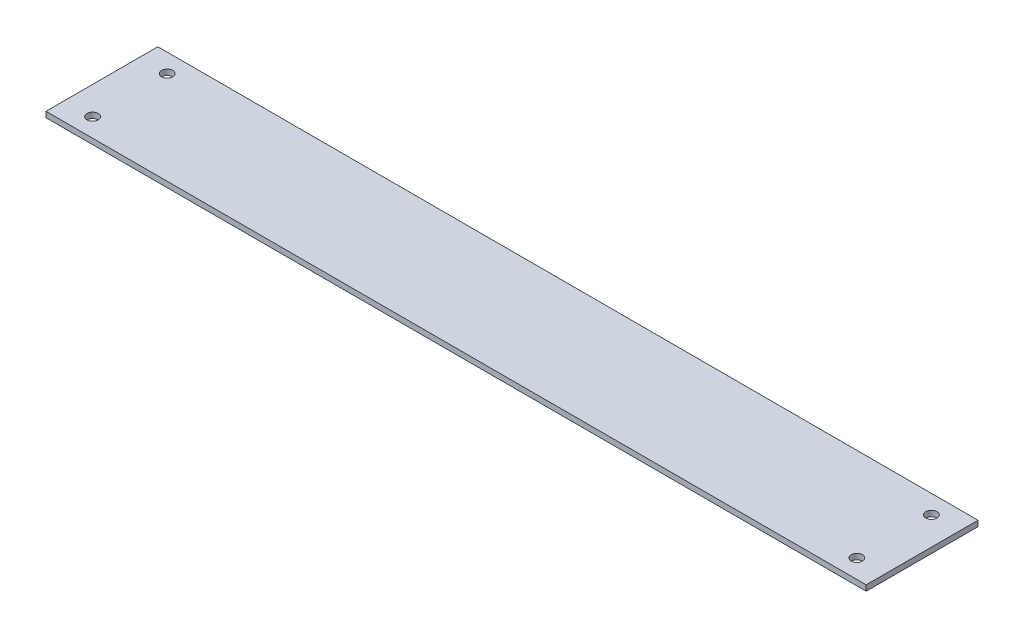
ISO-10303-21;
HEADER;
FILE_DESCRIPTION(('STEP AP214'),'2;1');
FILE_NAME('part.step','',(''),(''),'','','');
FILE_SCHEMA(('AUTOMOTIVE_DESIGN { 1 0 10303 214 1 1 1 1 }'));
ENDSEC;
DATA;
#1=APPLICATION_CONTEXT('core data for automotive mechanical design processes');
#2=APPLICATION_PROTOCOL_DEFINITION('international standard','automotive_design',2000,#1);
#3=PRODUCT_CONTEXT('',#1,'mechanical');
#4=PRODUCT('Part','Part','',(#3));
#5=PRODUCT_RELATED_PRODUCT_CATEGORY('part','',(#4));
#6=PRODUCT_DEFINITION_FORMATION('','',#4);
#7=PRODUCT_DEFINITION_CONTEXT('part definition',#1,'design');
#8=PRODUCT_DEFINITION('design','',#6,#7);
#9=PRODUCT_DEFINITION_SHAPE('','',#8);
#10=(LENGTH_UNIT() NAMED_UNIT(*) SI_UNIT(.MILLI.,.METRE.));
#11=(NAMED_UNIT(*) PLANE_ANGLE_UNIT() SI_UNIT($,.RADIAN.));
#12=(NAMED_UNIT(*) SI_UNIT($,.STERADIAN.) SOLID_ANGLE_UNIT());
#13=UNCERTAINTY_MEASURE_WITH_UNIT(LENGTH_MEASURE(1.E-05),#10,'distance_accuracy_value','');
#14=(GEOMETRIC_REPRESENTATION_CONTEXT(3) GLOBAL_UNCERTAINTY_ASSIGNED_CONTEXT((#13)) GLOBAL_UNIT_ASSIGNED_CONTEXT((#10,
#11,#12)) REPRESENTATION_CONTEXT('',''));
#15=CARTESIAN_POINT('',(0.,0.,0.));
#16=DIRECTION('',(0.,0.,1.));
#17=DIRECTION('',(1.,0.,0.));
#18=AXIS2_PLACEMENT_3D('',#15,#16,#17);
#19=CARTESIAN_POINT('',(0.,1.5,0.));
#20=DIRECTION('',(0.,1.,0.));
#21=DIRECTION('',(0.,0.,1.));
#22=AXIS2_PLACEMENT_3D('',#19,#20,#21);
#23=PLANE('',#22);
#24=CARTESIAN_POINT('',(102.5,1.5,-10.));
#25=DIRECTION('',(0.,1.,0.));
#26=DIRECTION('',(0.,0.,1.));
#27=AXIS2_PLACEMENT_3D('',#24,#25,#26);
#28=CIRCLE('',#27,1.5);
#29=CARTESIAN_POINT('',(102.5,1.5,-8.5));
#30=VERTEX_POINT('',#29);
#31=EDGE_CURVE('E121',#30,#30,#28,.T.);
#32=ORIENTED_EDGE('',*,*,#31,.F.);
#33=EDGE_LOOP('',(#32));
#34=FACE_BOUND('',#33,.T.);
#35=CARTESIAN_POINT('',(-102.5,1.5,-10.));
#36=DIRECTION('',(0.,1.,0.));
#37=DIRECTION('',(0.,0.,1.));
#38=AXIS2_PLACEMENT_3D('',#35,#36,#37);
#39=CIRCLE('',#38,1.5);
#40=CARTESIAN_POINT('',(-102.5,1.5,-8.5));
#41=VERTEX_POINT('',#40);
#42=EDGE_CURVE('E100',#41,#41,#39,.T.);
#43=ORIENTED_EDGE('',*,*,#42,.F.);
#44=EDGE_LOOP('',(#43));
#45=FACE_BOUND('',#44,.T.);
#46=DIRECTION('',(0.,0.,-1.));
#47=VECTOR('',#46,1.);
#48=CARTESIAN_POINT('',(110.,1.5,-15.));
#49=LINE('',#48,#47);
#50=CARTESIAN_POINT('',(110.,1.5,15.));
#51=VERTEX_POINT('',#50);
#52=CARTESIAN_POINT('',(110.,1.5,-15.));
#53=VERTEX_POINT('',#52);
#54=EDGE_CURVE('E85',#51,#53,#49,.T.);
#55=ORIENTED_EDGE('',*,*,#54,.T.);
#56=DIRECTION('',(-1.,0.,0.));
#57=VECTOR('',#56,1.);
#58=CARTESIAN_POINT('',(-110.,1.5,-15.));
#59=LINE('',#58,#57);
#60=CARTESIAN_POINT('',(-110.,1.5,-15.));
#61=VERTEX_POINT('',#60);
#62=EDGE_CURVE('E80',#53,#61,#59,.T.);
#63=ORIENTED_EDGE('',*,*,#62,.T.);
#64=DIRECTION('',(0.,0.,1.));
#65=VECTOR('',#64,1.);
#66=CARTESIAN_POINT('',(-110.,1.5,-15.));
#67=LINE('',#66,#65);
#68=CARTESIAN_POINT('',(-110.,1.5,15.));
#69=VERTEX_POINT('',#68);
#70=EDGE_CURVE('E83',#61,#69,#67,.T.);
#71=ORIENTED_EDGE('',*,*,#70,.T.);
#72=DIRECTION('',(1.,0.,0.));
#73=VECTOR('',#72,1.);
#74=CARTESIAN_POINT('',(-110.,1.5,15.));
#75=LINE('',#74,#73);
#76=EDGE_CURVE('E50',#69,#51,#75,.T.);
#77=ORIENTED_EDGE('',*,*,#76,.T.);
#78=EDGE_LOOP('',(#55,#63,#71,#77));
#79=FACE_BOUND('',#78,.T.);
#80=CARTESIAN_POINT('',(-102.5,1.5,10.));
#81=DIRECTION('',(0.,1.,0.));
#82=DIRECTION('',(0.,0.,1.));
#83=AXIS2_PLACEMENT_3D('',#80,#81,#82);
#84=CIRCLE('',#83,1.5);
#85=CARTESIAN_POINT('',(-102.5,1.5,11.5));
#86=VERTEX_POINT('',#85);
#87=EDGE_CURVE('E115',#86,#86,#84,.T.);
#88=ORIENTED_EDGE('',*,*,#87,.F.);
#89=EDGE_LOOP('',(#88));
#90=FACE_BOUND('',#89,.T.);
#91=CARTESIAN_POINT('',(102.5,1.5,10.));
#92=DIRECTION('',(0.,1.,0.));
#93=DIRECTION('',(0.,0.,1.));
#94=AXIS2_PLACEMENT_3D('',#91,#92,#93);
#95=CIRCLE('',#94,1.5);
#96=CARTESIAN_POINT('',(102.5,1.5,11.5));
#97=VERTEX_POINT('',#96);
#98=EDGE_CURVE('E127',#97,#97,#95,.T.);
#99=ORIENTED_EDGE('',*,*,#98,.F.);
#100=EDGE_LOOP('',(#99));
#101=FACE_BOUND('',#100,.T.);
#102=ADVANCED_FACE('F33',(#34,#45,#79,#90,#101),#23,.T.);
#103=CARTESIAN_POINT('',(0.,0.,0.));
#104=DIRECTION('',(0.,1.,0.));
#105=DIRECTION('',(0.,0.,1.));
#106=AXIS2_PLACEMENT_3D('',#103,#104,#105);
#107=PLANE('',#106);
#108=DIRECTION('',(0.,0.,-1.));
#109=VECTOR('',#108,1.);
#110=CARTESIAN_POINT('',(110.,0.,-15.));
#111=LINE('',#110,#109);
#112=CARTESIAN_POINT('',(110.,0.,15.));
#113=VERTEX_POINT('',#112);
#114=CARTESIAN_POINT('',(110.,0.,-15.));
#115=VERTEX_POINT('',#114);
#116=EDGE_CURVE('E97',#113,#115,#111,.T.);
#117=ORIENTED_EDGE('',*,*,#116,.F.);
#118=DIRECTION('',(1.,0.,0.));
#119=VECTOR('',#118,1.);
#120=CARTESIAN_POINT('',(-110.,0.,15.));
#121=LINE('',#120,#119);
#122=CARTESIAN_POINT('',(-110.,0.,15.));
#123=VERTEX_POINT('',#122);
#124=EDGE_CURVE('E73',#123,#113,#121,.T.);
#125=ORIENTED_EDGE('',*,*,#124,.F.);
#126=DIRECTION('',(0.,0.,1.));
#127=VECTOR('',#126,1.);
#128=CARTESIAN_POINT('',(-110.,0.,-15.));
#129=LINE('',#128,#127);
#130=CARTESIAN_POINT('',(-110.,0.,-15.));
#131=VERTEX_POINT('',#130);
#132=EDGE_CURVE('E67',#131,#123,#129,.T.);
#133=ORIENTED_EDGE('',*,*,#132,.F.);
#134=DIRECTION('',(-1.,0.,0.));
#135=VECTOR('',#134,1.);
#136=CARTESIAN_POINT('',(-110.,0.,-15.));
#137=LINE('',#136,#135);
#138=EDGE_CURVE('E89',#115,#131,#137,.T.);
#139=ORIENTED_EDGE('',*,*,#138,.F.);
#140=EDGE_LOOP('',(#117,#125,#133,#139));
#141=FACE_BOUND('',#140,.T.);
#142=CARTESIAN_POINT('',(-102.5,0.,-10.));
#143=DIRECTION('',(0.,1.,0.));
#144=DIRECTION('',(0.,0.,1.));
#145=AXIS2_PLACEMENT_3D('',#142,#143,#144);
#146=CIRCLE('',#145,1.5);
#147=CARTESIAN_POINT('',(-102.5,0.,-8.5));
#148=VERTEX_POINT('',#147);
#149=EDGE_CURVE('E112',#148,#148,#146,.T.);
#150=ORIENTED_EDGE('',*,*,#149,.T.);
#151=EDGE_LOOP('',(#150));
#152=FACE_BOUND('',#151,.T.);
#153=CARTESIAN_POINT('',(-102.5,0.,10.));
#154=DIRECTION('',(0.,1.,0.));
#155=DIRECTION('',(0.,0.,1.));
#156=AXIS2_PLACEMENT_3D('',#153,#154,#155);
#157=CIRCLE('',#156,1.5);
#158=CARTESIAN_POINT('',(-102.5,0.,11.5));
#159=VERTEX_POINT('',#158);
#160=EDGE_CURVE('E118',#159,#159,#157,.T.);
#161=ORIENTED_EDGE('',*,*,#160,.T.);
#162=EDGE_LOOP('',(#161));
#163=FACE_BOUND('',#162,.T.);
#164=CARTESIAN_POINT('',(102.5,0.,-10.));
#165=DIRECTION('',(0.,1.,0.));
#166=DIRECTION('',(0.,0.,1.));
#167=AXIS2_PLACEMENT_3D('',#164,#165,#166);
#168=CIRCLE('',#167,1.5);
#169=CARTESIAN_POINT('',(102.5,0.,-8.5));
#170=VERTEX_POINT('',#169);
#171=EDGE_CURVE('E124',#170,#170,#168,.T.);
#172=ORIENTED_EDGE('',*,*,#171,.T.);
#173=EDGE_LOOP('',(#172));
#174=FACE_BOUND('',#173,.T.);
#175=CARTESIAN_POINT('',(102.5,0.,10.));
#176=DIRECTION('',(0.,1.,0.));
#177=DIRECTION('',(0.,0.,1.));
#178=AXIS2_PLACEMENT_3D('',#175,#176,#177);
#179=CIRCLE('',#178,1.5);
#180=CARTESIAN_POINT('',(102.5,0.,11.5));
#181=VERTEX_POINT('',#180);
#182=EDGE_CURVE('E130',#181,#181,#179,.T.);
#183=ORIENTED_EDGE('',*,*,#182,.T.);
#184=EDGE_LOOP('',(#183));
#185=FACE_BOUND('',#184,.T.);
#186=ADVANCED_FACE('F108',(#141,#152,#163,#174,#185),#107,.F.);
#187=CARTESIAN_POINT('',(110.,1.5,-15.));
#188=DIRECTION('',(-1.,0.,0.));
#189=DIRECTION('',(0.,0.,1.));
#190=AXIS2_PLACEMENT_3D('',#187,#188,#189);
#191=PLANE('',#190);
#192=ORIENTED_EDGE('',*,*,#116,.T.);
#193=DIRECTION('',(0.,-1.,0.));
#194=VECTOR('',#193,1.);
#195=CARTESIAN_POINT('',(110.,1.5,-15.));
#196=LINE('',#195,#194);
#197=EDGE_CURVE('E11',#53,#115,#196,.T.);
#198=ORIENTED_EDGE('',*,*,#197,.F.);
#199=ORIENTED_EDGE('',*,*,#54,.F.);
#200=DIRECTION('',(0.,-1.,0.));
#201=VECTOR('',#200,1.);
#202=CARTESIAN_POINT('',(110.,1.5,15.));
#203=LINE('',#202,#201);
#204=EDGE_CURVE('E93',#51,#113,#203,.T.);
#205=ORIENTED_EDGE('',*,*,#204,.T.);
#206=EDGE_LOOP('',(#192,#198,#199,#205));
#207=FACE_BOUND('',#206,.T.);
#208=ADVANCED_FACE('F35',(#207),#191,.F.);
#209=CARTESIAN_POINT('',(-110.,1.5,-15.));
#210=DIRECTION('',(0.,0.,1.));
#211=DIRECTION('',(1.,0.,0.));
#212=AXIS2_PLACEMENT_3D('',#209,#210,#211);
#213=PLANE('',#212);
#214=ORIENTED_EDGE('',*,*,#138,.T.);
#215=DIRECTION('',(0.,-1.,0.));
#216=VECTOR('',#215,1.);
#217=CARTESIAN_POINT('',(-110.,1.5,-15.));
#218=LINE('',#217,#216);
#219=EDGE_CURVE('E42',#61,#131,#218,.T.);
#220=ORIENTED_EDGE('',*,*,#219,.F.);
#221=ORIENTED_EDGE('',*,*,#62,.F.);
#222=ORIENTED_EDGE('',*,*,#197,.T.);
#223=EDGE_LOOP('',(#214,#220,#221,#222));
#224=FACE_BOUND('',#223,.T.);
#225=ADVANCED_FACE('F88',(#224),#213,.F.);
#226=CARTESIAN_POINT('',(-110.,1.5,-15.));
#227=DIRECTION('',(1.,0.,0.));
#228=DIRECTION('',(0.,0.,-1.));
#229=AXIS2_PLACEMENT_3D('',#226,#227,#228);
#230=PLANE('',#229);
#231=ORIENTED_EDGE('',*,*,#132,.T.);
#232=DIRECTION('',(0.,-1.,0.));
#233=VECTOR('',#232,1.);
#234=CARTESIAN_POINT('',(-110.,1.5,15.));
#235=LINE('',#234,#233);
#236=EDGE_CURVE('E90',#69,#123,#235,.T.);
#237=ORIENTED_EDGE('',*,*,#236,.F.);
#238=ORIENTED_EDGE('',*,*,#70,.F.);
#239=ORIENTED_EDGE('',*,*,#219,.T.);
#240=EDGE_LOOP('',(#231,#237,#238,#239));
#241=FACE_BOUND('',#240,.T.);
#242=ADVANCED_FACE('F91',(#241),#230,.F.);
#243=CARTESIAN_POINT('',(-110.,1.5,15.));
#244=DIRECTION('',(0.,0.,-1.));
#245=DIRECTION('',(-1.,0.,0.));
#246=AXIS2_PLACEMENT_3D('',#243,#244,#245);
#247=PLANE('',#246);
#248=ORIENTED_EDGE('',*,*,#124,.T.);
#249=ORIENTED_EDGE('',*,*,#204,.F.);
#250=ORIENTED_EDGE('',*,*,#76,.F.);
#251=ORIENTED_EDGE('',*,*,#236,.T.);
#252=EDGE_LOOP('',(#248,#249,#250,#251));
#253=FACE_BOUND('',#252,.T.);
#254=ADVANCED_FACE('F105',(#253),#247,.F.);
#255=CARTESIAN_POINT('',(-102.5,1.5,-10.));
#256=DIRECTION('',(0.,-1.,0.));
#257=DIRECTION('',(0.,0.,-1.));
#258=AXIS2_PLACEMENT_3D('',#255,#256,#257);
#259=CYLINDRICAL_SURFACE('',#258,1.5);
#260=ORIENTED_EDGE('',*,*,#42,.T.);
#261=EDGE_LOOP('',(#260));
#262=FACE_BOUND('',#261,.T.);
#263=ORIENTED_EDGE('',*,*,#149,.F.);
#264=EDGE_LOOP('',(#263));
#265=FACE_BOUND('',#264,.T.);
#266=ADVANCED_FACE('F149',(#262,#265),#259,.F.);
#267=CARTESIAN_POINT('',(-102.5,1.5,10.));
#268=DIRECTION('',(0.,-1.,0.));
#269=DIRECTION('',(0.,0.,-1.));
#270=AXIS2_PLACEMENT_3D('',#267,#268,#269);
#271=CYLINDRICAL_SURFACE('',#270,1.5);
#272=ORIENTED_EDGE('',*,*,#87,.T.);
#273=EDGE_LOOP('',(#272));
#274=FACE_BOUND('',#273,.T.);
#275=ORIENTED_EDGE('',*,*,#160,.F.);
#276=EDGE_LOOP('',(#275));
#277=FACE_BOUND('',#276,.T.);
#278=ADVANCED_FACE('F195',(#274,#277),#271,.F.);
#279=CARTESIAN_POINT('',(102.5,1.5,-10.));
#280=DIRECTION('',(0.,-1.,0.));
#281=DIRECTION('',(0.,0.,-1.));
#282=AXIS2_PLACEMENT_3D('',#279,#280,#281);
#283=CYLINDRICAL_SURFACE('',#282,1.5);
#284=ORIENTED_EDGE('',*,*,#31,.T.);
#285=EDGE_LOOP('',(#284));
#286=FACE_BOUND('',#285,.T.);
#287=ORIENTED_EDGE('',*,*,#171,.F.);
#288=EDGE_LOOP('',(#287));
#289=FACE_BOUND('',#288,.T.);
#290=ADVANCED_FACE('F203',(#286,#289),#283,.F.);
#291=CARTESIAN_POINT('',(102.5,1.5,10.));
#292=DIRECTION('',(0.,-1.,0.));
#293=DIRECTION('',(0.,0.,-1.));
#294=AXIS2_PLACEMENT_3D('',#291,#292,#293);
#295=CYLINDRICAL_SURFACE('',#294,1.5);
#296=ORIENTED_EDGE('',*,*,#98,.T.);
#297=EDGE_LOOP('',(#296));
#298=FACE_BOUND('',#297,.T.);
#299=ORIENTED_EDGE('',*,*,#182,.F.);
#300=EDGE_LOOP('',(#299));
#301=FACE_BOUND('',#300,.T.);
#302=ADVANCED_FACE('F136',(#298,#301),#295,.F.);
#303=CLOSED_SHELL('',(#102,#186,#208,#225,#242,#254,#266,#278,#290,#302));
#304=MANIFOLD_SOLID_BREP('B2',#303);
#305=ADVANCED_BREP_SHAPE_REPRESENTATION('',(#18,#304),#14);
#306=SHAPE_DEFINITION_REPRESENTATION(#9,#305);
ENDSEC;
END-ISO-10303-21;
